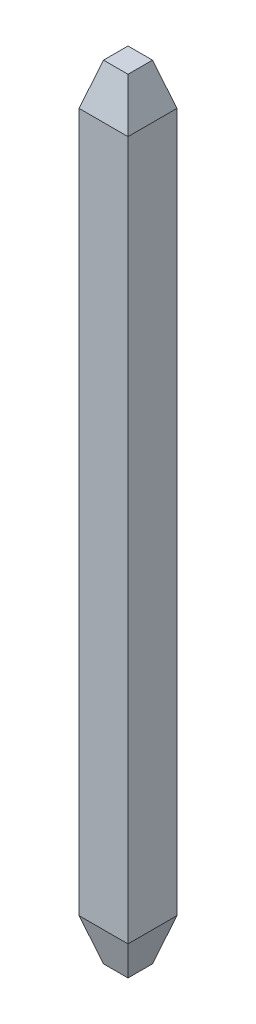
ISO-10303-21;
HEADER;
FILE_DESCRIPTION(('STEP AP214'),'2;1');
FILE_NAME('part.step','',(''),(''),'','','');
FILE_SCHEMA(('AUTOMOTIVE_DESIGN { 1 0 10303 214 1 1 1 1 }'));
ENDSEC;
DATA;
#1=APPLICATION_CONTEXT('core data for automotive mechanical design processes');
#2=APPLICATION_PROTOCOL_DEFINITION('international standard','automotive_design',2000,#1);
#3=PRODUCT_CONTEXT('',#1,'mechanical');
#4=PRODUCT('Part','Part','',(#3));
#5=PRODUCT_RELATED_PRODUCT_CATEGORY('part','',(#4));
#6=PRODUCT_DEFINITION_FORMATION('','',#4);
#7=PRODUCT_DEFINITION_CONTEXT('part definition',#1,'design');
#8=PRODUCT_DEFINITION('design','',#6,#7);
#9=PRODUCT_DEFINITION_SHAPE('','',#8);
#10=(LENGTH_UNIT() NAMED_UNIT(*) SI_UNIT(.MILLI.,.METRE.));
#11=(NAMED_UNIT(*) PLANE_ANGLE_UNIT() SI_UNIT($,.RADIAN.));
#12=(NAMED_UNIT(*) SI_UNIT($,.STERADIAN.) SOLID_ANGLE_UNIT());
#13=UNCERTAINTY_MEASURE_WITH_UNIT(LENGTH_MEASURE(1.E-05),#10,'distance_accuracy_value','');
#14=(GEOMETRIC_REPRESENTATION_CONTEXT(3) GLOBAL_UNCERTAINTY_ASSIGNED_CONTEXT((#13)) GLOBAL_UNIT_ASSIGNED_CONTEXT((#10,
#11,#12)) REPRESENTATION_CONTEXT('',''));
#15=CARTESIAN_POINT('',(0.,0.,0.));
#16=DIRECTION('',(0.,0.,1.));
#17=DIRECTION('',(1.,0.,0.));
#18=AXIS2_PLACEMENT_3D('',#15,#16,#17);
#19=CARTESIAN_POINT('',(-28.729999999987,-11.0738701069128,-16.9799999999763));
#20=DIRECTION('',(1.,0.,0.));
#21=DIRECTION('',(0.,1.,0.));
#22=AXIS2_PLACEMENT_3D('',#19,#20,#21);
#23=PLANE('',#22);
#24=DIRECTION('',(0.,1.,0.));
#25=VECTOR('',#24,1.);
#26=CARTESIAN_POINT('',(-28.729999999987,-10.1039999999833,-16.6599999999763));
#27=LINE('',#26,#25);
#28=CARTESIAN_POINT('',(-28.729999999987,-10.1039999999833,-16.6599999999763));
#29=VERTEX_POINT('',#28);
#30=CARTESIAN_POINT('',(-28.729999999987,-0.965870106912755,-16.6599999999763));
#31=VERTEX_POINT('',#30);
#32=EDGE_CURVE('E165',#29,#31,#27,.T.);
#33=ORIENTED_EDGE('',*,*,#32,.F.);
#34=DIRECTION('',(0.,0.,1.));
#35=VECTOR('',#34,1.);
#36=CARTESIAN_POINT('',(-28.729999999987,-10.1039999999833,-17.2999999999763));
#37=LINE('',#36,#35);
#38=CARTESIAN_POINT('',(-28.729999999987,-10.1039999999833,-17.2999999999763));
#39=VERTEX_POINT('',#38);
#40=EDGE_CURVE('E42',#39,#29,#37,.T.);
#41=ORIENTED_EDGE('',*,*,#40,.F.);
#42=DIRECTION('',(0.,1.,0.));
#43=VECTOR('',#42,1.);
#44=CARTESIAN_POINT('',(-28.729999999987,-10.1039999999833,-17.2999999999763));
#45=LINE('',#44,#43);
#46=CARTESIAN_POINT('',(-28.729999999987,-0.965870106912755,-17.2999999999763));
#47=VERTEX_POINT('',#46);
#48=EDGE_CURVE('E11',#39,#47,#45,.T.);
#49=ORIENTED_EDGE('',*,*,#48,.T.);
#50=DIRECTION('',(0.,0.,1.));
#51=VECTOR('',#50,1.);
#52=CARTESIAN_POINT('',(-28.729999999987,-0.965870106912753,-17.2999999999763));
#53=LINE('',#52,#51);
#54=EDGE_CURVE('E28',#47,#31,#53,.T.);
#55=ORIENTED_EDGE('',*,*,#54,.T.);
#56=EDGE_LOOP('',(#33,#41,#49,#55));
#57=FACE_BOUND('',#56,.T.);
#58=ADVANCED_FACE('F17',(#57),#23,.T.);
#59=CARTESIAN_POINT('',(-29.370999999987,-5.53543505344803,-16.6599999999763));
#60=DIRECTION('',(0.,0.,1.));
#61=DIRECTION('',(1.,0.,0.));
#62=AXIS2_PLACEMENT_3D('',#59,#60,#61);
#63=PLANE('',#62);
#64=DIRECTION('',(0.,1.,0.));
#65=VECTOR('',#64,1.);
#66=CARTESIAN_POINT('',(-29.369999999987,-10.1039999999833,-16.6599999999763));
#67=LINE('',#66,#65);
#68=CARTESIAN_POINT('',(-29.369999999987,-10.1039999999833,-16.6599999999763));
#69=VERTEX_POINT('',#68);
#70=CARTESIAN_POINT('',(-29.369999999987,-0.965870106912755,-16.6599999999763));
#71=VERTEX_POINT('',#70);
#72=EDGE_CURVE('E172',#69,#71,#67,.T.);
#73=ORIENTED_EDGE('',*,*,#72,.F.);
#74=DIRECTION('',(-1.,0.,0.));
#75=VECTOR('',#74,1.);
#76=CARTESIAN_POINT('',(-28.729999999987,-10.1039999999833,-16.6599999999763));
#77=LINE('',#76,#75);
#78=EDGE_CURVE('E125',#29,#69,#77,.T.);
#79=ORIENTED_EDGE('',*,*,#78,.F.);
#80=ORIENTED_EDGE('',*,*,#32,.T.);
#81=DIRECTION('',(-1.,0.,0.));
#82=VECTOR('',#81,1.);
#83=CARTESIAN_POINT('',(-28.729999999987,-0.965870106912753,-16.6599999999763));
#84=LINE('',#83,#82);
#85=EDGE_CURVE('E168',#31,#71,#84,.T.);
#86=ORIENTED_EDGE('',*,*,#85,.T.);
#87=EDGE_LOOP('',(#73,#79,#80,#86));
#88=FACE_BOUND('',#87,.T.);
#89=ADVANCED_FACE('F204',(#88),#63,.T.);
#90=CARTESIAN_POINT('',(-29.369999999987,-5.53543505344803,-16.6589999999763));
#91=DIRECTION('',(-1.,0.,0.));
#92=DIRECTION('',(0.,0.,1.));
#93=AXIS2_PLACEMENT_3D('',#90,#91,#92);
#94=PLANE('',#93);
#95=DIRECTION('',(0.,1.,0.));
#96=VECTOR('',#95,1.);
#97=CARTESIAN_POINT('',(-29.369999999987,-10.1039999999833,-17.2999999999763));
#98=LINE('',#97,#96);
#99=CARTESIAN_POINT('',(-29.369999999987,-10.1039999999833,-17.2999999999763));
#100=VERTEX_POINT('',#99);
#101=CARTESIAN_POINT('',(-29.369999999987,-0.965870106912755,-17.2999999999763));
#102=VERTEX_POINT('',#101);
#103=EDGE_CURVE('E143',#100,#102,#98,.T.);
#104=ORIENTED_EDGE('',*,*,#103,.F.);
#105=DIRECTION('',(0.,0.,-1.));
#106=VECTOR('',#105,1.);
#107=CARTESIAN_POINT('',(-29.369999999987,-10.1039999999833,-16.6599999999763));
#108=LINE('',#107,#106);
#109=EDGE_CURVE('E153',#69,#100,#108,.T.);
#110=ORIENTED_EDGE('',*,*,#109,.F.);
#111=ORIENTED_EDGE('',*,*,#72,.T.);
#112=DIRECTION('',(0.,0.,-1.));
#113=VECTOR('',#112,1.);
#114=CARTESIAN_POINT('',(-29.369999999987,-0.965870106912753,-16.6599999999763));
#115=LINE('',#114,#113);
#116=EDGE_CURVE('E116',#71,#102,#115,.T.);
#117=ORIENTED_EDGE('',*,*,#116,.T.);
#118=EDGE_LOOP('',(#104,#110,#111,#117));
#119=FACE_BOUND('',#118,.T.);
#120=ADVANCED_FACE('F399',(#119),#94,.T.);
#121=CARTESIAN_POINT('',(-29.369999999987,-0.965870106912753,-16.9799999999763));
#122=DIRECTION('',(-0.959644900900968,0.281214622974644,0.));
#123=DIRECTION('',(0.,0.,1.));
#124=AXIS2_PLACEMENT_3D('',#121,#122,#123);
#125=PLANE('',#124);
#126=DIRECTION('',(0.270714017147727,0.923811583516617,-0.270714017147727));
#127=VECTOR('',#126,1.);
#128=CARTESIAN_POINT('',(-29.369999999987,-0.965870106912753,-16.6599999999763));
#129=LINE('',#128,#127);
#130=CARTESIAN_POINT('',(-29.209999999987,-0.419870106912756,-16.8199999999763));
#131=VERTEX_POINT('',#130);
#132=EDGE_CURVE('E111',#71,#131,#129,.T.);
#133=ORIENTED_EDGE('',*,*,#132,.T.);
#134=DIRECTION('',(0.,0.,-1.));
#135=VECTOR('',#134,1.);
#136=CARTESIAN_POINT('',(-29.209999999987,-0.419870106912754,-16.8199999999763));
#137=LINE('',#136,#135);
#138=CARTESIAN_POINT('',(-29.209999999987,-0.419870106912756,-17.1399999999763));
#139=VERTEX_POINT('',#138);
#140=EDGE_CURVE('E21',#131,#139,#137,.T.);
#141=ORIENTED_EDGE('',*,*,#140,.T.);
#142=DIRECTION('',(0.270714017147727,0.923811583516617,0.270714017147727));
#143=VECTOR('',#142,1.);
#144=CARTESIAN_POINT('',(-29.369999999987,-0.965870106912753,-17.2999999999763));
#145=LINE('',#144,#143);
#146=EDGE_CURVE('E112',#102,#139,#145,.T.);
#147=ORIENTED_EDGE('',*,*,#146,.F.);
#148=ORIENTED_EDGE('',*,*,#116,.F.);
#149=EDGE_LOOP('',(#133,#141,#147,#148));
#150=FACE_BOUND('',#149,.T.);
#151=ADVANCED_FACE('F114',(#150),#125,.T.);
#152=CARTESIAN_POINT('',(-29.049999999987,-0.965870106912753,-17.2999999999763));
#153=DIRECTION('',(0.,0.281214622974644,-0.959644900900968));
#154=DIRECTION('',(-1.,0.,0.));
#155=AXIS2_PLACEMENT_3D('',#152,#153,#154);
#156=PLANE('',#155);
#157=ORIENTED_EDGE('',*,*,#146,.T.);
#158=DIRECTION('',(1.,0.,0.));
#159=VECTOR('',#158,1.);
#160=CARTESIAN_POINT('',(-29.209999999987,-0.419870106912754,-17.1399999999763));
#161=LINE('',#160,#159);
#162=CARTESIAN_POINT('',(-28.889999999987,-0.419870106912756,-17.1399999999763));
#163=VERTEX_POINT('',#162);
#164=EDGE_CURVE('E107',#139,#163,#161,.T.);
#165=ORIENTED_EDGE('',*,*,#164,.T.);
#166=DIRECTION('',(-0.270714017147727,0.923811583516617,0.270714017147727));
#167=VECTOR('',#166,1.);
#168=CARTESIAN_POINT('',(-28.729999999987,-0.965870106912753,-17.2999999999763));
#169=LINE('',#168,#167);
#170=EDGE_CURVE('E161',#47,#163,#169,.T.);
#171=ORIENTED_EDGE('',*,*,#170,.F.);
#172=DIRECTION('',(1.,0.,0.));
#173=VECTOR('',#172,1.);
#174=CARTESIAN_POINT('',(-29.369999999987,-0.965870106912753,-17.2999999999763));
#175=LINE('',#174,#173);
#176=EDGE_CURVE('E139',#102,#47,#175,.T.);
#177=ORIENTED_EDGE('',*,*,#176,.F.);
#178=EDGE_LOOP('',(#157,#165,#171,#177));
#179=FACE_BOUND('',#178,.T.);
#180=ADVANCED_FACE('F214',(#179),#156,.T.);
#181=CARTESIAN_POINT('',(-29.049999999987,-0.419870106912754,-17.1409999999763));
#182=DIRECTION('',(0.,1.,0.));
#183=DIRECTION('',(1.,0.,0.));
#184=AXIS2_PLACEMENT_3D('',#181,#182,#183);
#185=PLANE('',#184);
#186=ORIENTED_EDGE('',*,*,#164,.F.);
#187=ORIENTED_EDGE('',*,*,#140,.F.);
#188=DIRECTION('',(-1.,0.,0.));
#189=VECTOR('',#188,1.);
#190=CARTESIAN_POINT('',(-28.889999999987,-0.419870106912754,-16.8199999999763));
#191=LINE('',#190,#189);
#192=CARTESIAN_POINT('',(-28.889999999987,-0.419870106912756,-16.8199999999763));
#193=VERTEX_POINT('',#192);
#194=EDGE_CURVE('E104',#193,#131,#191,.T.);
#195=ORIENTED_EDGE('',*,*,#194,.F.);
#196=DIRECTION('',(0.,0.,1.));
#197=VECTOR('',#196,1.);
#198=CARTESIAN_POINT('',(-28.889999999987,-0.419870106912754,-17.1399999999763));
#199=LINE('',#198,#197);
#200=EDGE_CURVE('E164',#163,#193,#199,.T.);
#201=ORIENTED_EDGE('',*,*,#200,.F.);
#202=EDGE_LOOP('',(#186,#187,#195,#201));
#203=FACE_BOUND('',#202,.T.);
#204=ADVANCED_FACE('F101',(#203),#185,.T.);
#205=CARTESIAN_POINT('',(-29.369999999987,-10.1039999999833,-16.9799999999763));
#206=DIRECTION('',(-0.959644900900969,-0.281214622974642,0.));
#207=DIRECTION('',(-0.281214622974642,0.959644900900969,0.));
#208=AXIS2_PLACEMENT_3D('',#205,#206,#207);
#209=PLANE('',#208);
#210=ORIENTED_EDGE('',*,*,#109,.T.);
#211=DIRECTION('',(0.270714017147726,-0.923811583516618,0.270714017147726));
#212=VECTOR('',#211,1.);
#213=CARTESIAN_POINT('',(-29.369999999987,-10.1039999999833,-17.2999999999763));
#214=LINE('',#213,#212);
#215=CARTESIAN_POINT('',(-29.209999999987,-10.6499999999833,-17.1399999999763));
#216=VERTEX_POINT('',#215);
#217=EDGE_CURVE('E149',#100,#216,#214,.T.);
#218=ORIENTED_EDGE('',*,*,#217,.T.);
#219=DIRECTION('',(0.,0.,-1.));
#220=VECTOR('',#219,1.);
#221=CARTESIAN_POINT('',(-29.209999999987,-10.6499999999833,-16.8199999999763));
#222=LINE('',#221,#220);
#223=CARTESIAN_POINT('',(-29.209999999987,-10.6499999999833,-16.8199999999763));
#224=VERTEX_POINT('',#223);
#225=EDGE_CURVE('E146',#224,#216,#222,.T.);
#226=ORIENTED_EDGE('',*,*,#225,.F.);
#227=DIRECTION('',(0.270714017147726,-0.923811583516618,-0.270714017147726));
#228=VECTOR('',#227,1.);
#229=CARTESIAN_POINT('',(-29.369999999987,-10.1039999999833,-16.6599999999763));
#230=LINE('',#229,#228);
#231=EDGE_CURVE('E134',#69,#224,#230,.T.);
#232=ORIENTED_EDGE('',*,*,#231,.F.);
#233=EDGE_LOOP('',(#210,#218,#226,#232));
#234=FACE_BOUND('',#233,.T.);
#235=ADVANCED_FACE('F234',(#234),#209,.T.);
#236=CARTESIAN_POINT('',(-29.210999999987,-10.6499999999833,-16.9799999999763));
#237=DIRECTION('',(0.,-1.,0.));
#238=DIRECTION('',(0.,0.,-1.));
#239=AXIS2_PLACEMENT_3D('',#236,#237,#238);
#240=PLANE('',#239);
#241=DIRECTION('',(0.,0.,1.));
#242=VECTOR('',#241,1.);
#243=CARTESIAN_POINT('',(-28.889999999987,-10.6499999999833,-17.1399999999763));
#244=LINE('',#243,#242);
#245=CARTESIAN_POINT('',(-28.889999999987,-10.6499999999833,-17.1399999999763));
#246=VERTEX_POINT('',#245);
#247=CARTESIAN_POINT('',(-28.889999999987,-10.6499999999833,-16.8199999999763));
#248=VERTEX_POINT('',#247);
#249=EDGE_CURVE('E154',#246,#248,#244,.T.);
#250=ORIENTED_EDGE('',*,*,#249,.T.);
#251=DIRECTION('',(-1.,0.,0.));
#252=VECTOR('',#251,1.);
#253=CARTESIAN_POINT('',(-28.889999999987,-10.6499999999833,-16.8199999999763));
#254=LINE('',#253,#252);
#255=EDGE_CURVE('E160',#248,#224,#254,.T.);
#256=ORIENTED_EDGE('',*,*,#255,.T.);
#257=ORIENTED_EDGE('',*,*,#225,.T.);
#258=DIRECTION('',(1.,0.,0.));
#259=VECTOR('',#258,1.);
#260=CARTESIAN_POINT('',(-29.209999999987,-10.6499999999833,-17.1399999999763));
#261=LINE('',#260,#259);
#262=EDGE_CURVE('E144',#216,#246,#261,.T.);
#263=ORIENTED_EDGE('',*,*,#262,.T.);
#264=EDGE_LOOP('',(#250,#256,#257,#263));
#265=FACE_BOUND('',#264,.T.);
#266=ADVANCED_FACE('F225',(#265),#240,.T.);
#267=CARTESIAN_POINT('',(-29.049999999987,-10.1039999999833,-17.2999999999763));
#268=DIRECTION('',(0.,-0.281214622974642,-0.959644900900969));
#269=DIRECTION('',(0.,-0.959644900900969,0.281214622974642));
#270=AXIS2_PLACEMENT_3D('',#267,#268,#269);
#271=PLANE('',#270);
#272=DIRECTION('',(1.,0.,0.));
#273=VECTOR('',#272,1.);
#274=CARTESIAN_POINT('',(-29.369999999987,-10.1039999999833,-17.2999999999763));
#275=LINE('',#274,#273);
#276=EDGE_CURVE('E147',#100,#39,#275,.T.);
#277=ORIENTED_EDGE('',*,*,#276,.T.);
#278=DIRECTION('',(-0.270714017147726,-0.923811583516618,0.270714017147726));
#279=VECTOR('',#278,1.);
#280=CARTESIAN_POINT('',(-28.729999999987,-10.1039999999833,-17.2999999999763));
#281=LINE('',#280,#279);
#282=EDGE_CURVE('E132',#39,#246,#281,.T.);
#283=ORIENTED_EDGE('',*,*,#282,.T.);
#284=ORIENTED_EDGE('',*,*,#262,.F.);
#285=ORIENTED_EDGE('',*,*,#217,.F.);
#286=EDGE_LOOP('',(#277,#283,#284,#285));
#287=FACE_BOUND('',#286,.T.);
#288=ADVANCED_FACE('F284',(#287),#271,.T.);
#289=CARTESIAN_POINT('',(-29.049999999987,-0.965870106912753,-16.6599999999763));
#290=DIRECTION('',(0.,0.281214622974644,0.959644900900968));
#291=DIRECTION('',(1.,0.,0.));
#292=AXIS2_PLACEMENT_3D('',#289,#290,#291);
#293=PLANE('',#292);
#294=DIRECTION('',(-0.270714017147727,0.923811583516617,-0.270714017147727));
#295=VECTOR('',#294,1.);
#296=CARTESIAN_POINT('',(-28.729999999987,-0.965870106912753,-16.6599999999763));
#297=LINE('',#296,#295);
#298=EDGE_CURVE('E123',#31,#193,#297,.T.);
#299=ORIENTED_EDGE('',*,*,#298,.T.);
#300=ORIENTED_EDGE('',*,*,#194,.T.);
#301=ORIENTED_EDGE('',*,*,#132,.F.);
#302=ORIENTED_EDGE('',*,*,#85,.F.);
#303=EDGE_LOOP('',(#299,#300,#301,#302));
#304=FACE_BOUND('',#303,.T.);
#305=ADVANCED_FACE('F121',(#304),#293,.T.);
#306=CARTESIAN_POINT('',(-29.049999999987,-10.1039999999833,-16.6599999999763));
#307=DIRECTION('',(0.,-0.281214622974642,0.959644900900969));
#308=DIRECTION('',(-1.,0.,0.));
#309=AXIS2_PLACEMENT_3D('',#306,#307,#308);
#310=PLANE('',#309);
#311=ORIENTED_EDGE('',*,*,#78,.T.);
#312=ORIENTED_EDGE('',*,*,#231,.T.);
#313=ORIENTED_EDGE('',*,*,#255,.F.);
#314=DIRECTION('',(-0.270714017147726,-0.923811583516618,-0.270714017147726));
#315=VECTOR('',#314,1.);
#316=CARTESIAN_POINT('',(-28.729999999987,-10.1039999999833,-16.6599999999763));
#317=LINE('',#316,#315);
#318=EDGE_CURVE('E179',#29,#248,#317,.T.);
#319=ORIENTED_EDGE('',*,*,#318,.F.);
#320=EDGE_LOOP('',(#311,#312,#313,#319));
#321=FACE_BOUND('',#320,.T.);
#322=ADVANCED_FACE('F230',(#321),#310,.T.);
#323=CARTESIAN_POINT('',(-28.729999999987,-0.965870106912753,-16.9799999999763));
#324=DIRECTION('',(0.959644900900968,0.281214622974644,0.));
#325=DIRECTION('',(0.,0.,-1.));
#326=AXIS2_PLACEMENT_3D('',#323,#324,#325);
#327=PLANE('',#326);
#328=ORIENTED_EDGE('',*,*,#170,.T.);
#329=ORIENTED_EDGE('',*,*,#200,.T.);
#330=ORIENTED_EDGE('',*,*,#298,.F.);
#331=ORIENTED_EDGE('',*,*,#54,.F.);
#332=EDGE_LOOP('',(#328,#329,#330,#331));
#333=FACE_BOUND('',#332,.T.);
#334=ADVANCED_FACE('F19',(#333),#327,.T.);
#335=CARTESIAN_POINT('',(-28.728999999987,-5.53443505344803,-17.2999999999763));
#336=DIRECTION('',(0.,0.,-1.));
#337=DIRECTION('',(0.,-1.,0.));
#338=AXIS2_PLACEMENT_3D('',#335,#336,#337);
#339=PLANE('',#338);
#340=ORIENTED_EDGE('',*,*,#48,.F.);
#341=ORIENTED_EDGE('',*,*,#276,.F.);
#342=ORIENTED_EDGE('',*,*,#103,.T.);
#343=ORIENTED_EDGE('',*,*,#176,.T.);
#344=EDGE_LOOP('',(#340,#341,#342,#343));
#345=FACE_BOUND('',#344,.T.);
#346=ADVANCED_FACE('F408',(#345),#339,.T.);
#347=CARTESIAN_POINT('',(-28.729999999987,-10.1039999999833,-16.9799999999763));
#348=DIRECTION('',(0.959644900900969,-0.281214622974642,0.));
#349=DIRECTION('',(0.,0.,-1.));
#350=AXIS2_PLACEMENT_3D('',#347,#348,#349);
#351=PLANE('',#350);
#352=ORIENTED_EDGE('',*,*,#40,.T.);
#353=ORIENTED_EDGE('',*,*,#318,.T.);
#354=ORIENTED_EDGE('',*,*,#249,.F.);
#355=ORIENTED_EDGE('',*,*,#282,.F.);
#356=EDGE_LOOP('',(#352,#353,#354,#355));
#357=FACE_BOUND('',#356,.T.);
#358=ADVANCED_FACE('F228',(#357),#351,.T.);
#359=CLOSED_SHELL('',(#58,#89,#120,#151,#180,#204,#235,#266,#288,#305,#322,#334,#346,#358));
#360=MANIFOLD_SOLID_BREP('B1',#359);
#361=ADVANCED_BREP_SHAPE_REPRESENTATION('',(#18,#360),#14);
#362=SHAPE_DEFINITION_REPRESENTATION(#9,#361);
ENDSEC;
END-ISO-10303-21;
